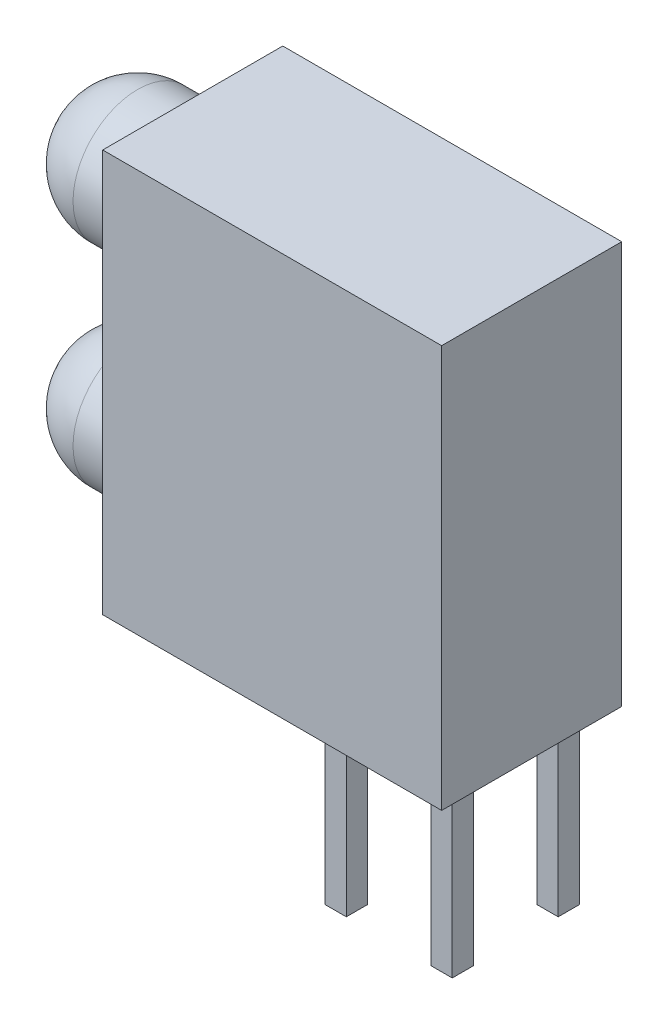
ISO-10303-21;
HEADER;
FILE_DESCRIPTION(('STEP AP214'),'2;1');
FILE_NAME('part.step','',(''),(''),'','','');
FILE_SCHEMA(('AUTOMOTIVE_DESIGN { 1 0 10303 214 1 1 1 1 }'));
ENDSEC;
DATA;
#1=APPLICATION_CONTEXT('core data for automotive mechanical design processes');
#2=APPLICATION_PROTOCOL_DEFINITION('international standard','automotive_design',2000,#1);
#3=PRODUCT_CONTEXT('',#1,'mechanical');
#4=PRODUCT('Part','Part','',(#3));
#5=PRODUCT_RELATED_PRODUCT_CATEGORY('part','',(#4));
#6=PRODUCT_DEFINITION_FORMATION('','',#4);
#7=PRODUCT_DEFINITION_CONTEXT('part definition',#1,'design');
#8=PRODUCT_DEFINITION('design','',#6,#7);
#9=PRODUCT_DEFINITION_SHAPE('','',#8);
#10=(LENGTH_UNIT() NAMED_UNIT(*) SI_UNIT(.MILLI.,.METRE.));
#11=(NAMED_UNIT(*) PLANE_ANGLE_UNIT() SI_UNIT($,.RADIAN.));
#12=(NAMED_UNIT(*) SI_UNIT($,.STERADIAN.) SOLID_ANGLE_UNIT());
#13=UNCERTAINTY_MEASURE_WITH_UNIT(LENGTH_MEASURE(1.E-05),#10,'distance_accuracy_value','');
#14=(GEOMETRIC_REPRESENTATION_CONTEXT(3) GLOBAL_UNCERTAINTY_ASSIGNED_CONTEXT((#13)) GLOBAL_UNIT_ASSIGNED_CONTEXT((#10,
#11,#12)) REPRESENTATION_CONTEXT('',''));
#15=CARTESIAN_POINT('',(0.,0.,0.));
#16=DIRECTION('',(0.,0.,1.));
#17=DIRECTION('',(1.,0.,0.));
#18=AXIS2_PLACEMENT_3D('',#15,#16,#17);
#19=CARTESIAN_POINT('',(0.,0.,0.));
#20=DIRECTION('',(1.,0.,0.));
#21=DIRECTION('',(0.,0.,-1.));
#22=AXIS2_PLACEMENT_3D('',#19,#20,#21);
#23=PLANE('',#22);
#24=CARTESIAN_POINT('',(0.,2.54,0.));
#25=DIRECTION('',(1.,0.,0.));
#26=DIRECTION('',(0.,0.,-1.));
#27=AXIS2_PLACEMENT_3D('',#24,#25,#26);
#28=CIRCLE('',#27,1.5494);
#29=CARTESIAN_POINT('',(0.,2.54,-1.5494));
#30=VERTEX_POINT('',#29);
#31=EDGE_CURVE('E80',#30,#30,#28,.T.);
#32=ORIENTED_EDGE('',*,*,#31,.T.);
#33=EDGE_LOOP('',(#32));
#34=FACE_BOUND('',#33,.T.);
#35=ADVANCED_FACE('F53',(#34),#23,.T.);
#36=CARTESIAN_POINT('',(-1.3208,2.54,0.));
#37=DIRECTION('',(0.,0.,1.));
#38=DIRECTION('',(-1.,0.,0.));
#39=AXIS2_PLACEMENT_3D('',#36,#37,#38);
#40=SPHERICAL_SURFACE('',#39,1.4986);
#41=OFFSET_SURFACE('',#40,0.0508,.F.);
#42=CARTESIAN_POINT('',(-1.3208,2.54,0.));
#43=DIRECTION('',(1.,0.,0.));
#44=DIRECTION('',(0.,0.,1.));
#45=AXIS2_PLACEMENT_3D('',#42,#43,#44);
#46=CIRCLE('',#45,1.5494);
#47=CARTESIAN_POINT('',(-1.3208,2.54,1.5494));
#48=VERTEX_POINT('',#47);
#49=CARTESIAN_POINT('',(-1.32079999999998,2.54,-1.5494));
#50=VERTEX_POINT('',#49);
#51=EDGE_CURVE('E14',#48,#50,#46,.T.);
#52=ORIENTED_EDGE('',*,*,#51,.F.);
#53=CARTESIAN_POINT('',(-1.3208,2.54,0.));
#54=DIRECTION('',(1.,0.,0.));
#55=DIRECTION('',(0.,0.,-1.));
#56=AXIS2_PLACEMENT_3D('',#53,#54,#55);
#57=CIRCLE('',#56,1.5494);
#58=EDGE_CURVE('E66',#48,#50,#57,.F.);
#59=ORIENTED_EDGE('',*,*,#58,.T.);
#60=EDGE_LOOP('',(#52,#59));
#61=FACE_BOUND('',#60,.T.);
#62=ADVANCED_FACE('F74',(#61),#41,.T.);
#63=CARTESIAN_POINT('',(-0.254,2.54,0.));
#64=DIRECTION('',(1.,0.,0.));
#65=DIRECTION('',(0.,1.,0.));
#66=AXIS2_PLACEMENT_3D('',#63,#64,#65);
#67=CYLINDRICAL_SURFACE('',#66,1.5494);
#68=ORIENTED_EDGE('',*,*,#51,.T.);
#69=ORIENTED_EDGE('',*,*,#58,.F.);
#70=EDGE_LOOP('',(#68,#69));
#71=FACE_BOUND('',#70,.T.);
#72=ORIENTED_EDGE('',*,*,#31,.F.);
#73=EDGE_LOOP('',(#72));
#74=FACE_BOUND('',#73,.T.);
#75=ADVANCED_FACE('F78',(#71,#74),#67,.T.);
#76=CLOSED_SHELL('',(#35,#62,#75));
#77=MANIFOLD_SOLID_BREP('B2',#76);
#78=CARTESIAN_POINT('',(0.,0.,0.));
#79=DIRECTION('',(1.,0.,0.));
#80=DIRECTION('',(0.,0.,-1.));
#81=AXIS2_PLACEMENT_3D('',#78,#79,#80);
#82=PLANE('',#81);
#83=CARTESIAN_POINT('',(0.,7.62,0.));
#84=DIRECTION('',(1.,0.,0.));
#85=DIRECTION('',(0.,0.,-1.));
#86=AXIS2_PLACEMENT_3D('',#83,#84,#85);
#87=CIRCLE('',#86,1.5494);
#88=CARTESIAN_POINT('',(0.,7.62,-1.5494));
#89=VERTEX_POINT('',#88);
#90=EDGE_CURVE('E188',#89,#89,#87,.F.);
#91=ORIENTED_EDGE('',*,*,#90,.F.);
#92=EDGE_LOOP('',(#91));
#93=FACE_BOUND('',#92,.T.);
#94=ADVANCED_FACE('F165',(#93),#82,.T.);
#95=CARTESIAN_POINT('',(-1.3208,7.62,0.));
#96=DIRECTION('',(0.,0.,1.));
#97=DIRECTION('',(-1.,0.,0.));
#98=AXIS2_PLACEMENT_3D('',#95,#96,#97);
#99=SPHERICAL_SURFACE('',#98,1.4986);
#100=OFFSET_SURFACE('',#99,0.0508,.F.);
#101=CARTESIAN_POINT('',(-1.3208,7.62,0.));
#102=DIRECTION('',(1.,0.,0.));
#103=DIRECTION('',(0.,0.,1.));
#104=AXIS2_PLACEMENT_3D('',#101,#102,#103);
#105=CIRCLE('',#104,1.5494);
#106=CARTESIAN_POINT('',(-1.32079999999998,7.62,-1.5494));
#107=VERTEX_POINT('',#106);
#108=CARTESIAN_POINT('',(-1.3208,7.62,1.5494));
#109=VERTEX_POINT('',#108);
#110=EDGE_CURVE('E178',#107,#109,#105,.F.);
#111=ORIENTED_EDGE('',*,*,#110,.T.);
#112=CARTESIAN_POINT('',(-1.3208,7.62,0.));
#113=DIRECTION('',(1.,0.,0.));
#114=DIRECTION('',(0.,0.,-1.));
#115=AXIS2_PLACEMENT_3D('',#112,#113,#114);
#116=CIRCLE('',#115,1.5494);
#117=EDGE_CURVE('E51',#109,#107,#116,.F.);
#118=ORIENTED_EDGE('',*,*,#117,.T.);
#119=EDGE_LOOP('',(#111,#118));
#120=FACE_BOUND('',#119,.T.);
#121=ADVANCED_FACE('F185',(#120),#100,.T.);
#122=CARTESIAN_POINT('',(-0.254,7.62,0.));
#123=DIRECTION('',(1.,0.,0.));
#124=DIRECTION('',(0.,1.,0.));
#125=AXIS2_PLACEMENT_3D('',#122,#123,#124);
#126=CYLINDRICAL_SURFACE('',#125,1.5494);
#127=ORIENTED_EDGE('',*,*,#110,.F.);
#128=ORIENTED_EDGE('',*,*,#117,.F.);
#129=EDGE_LOOP('',(#127,#128));
#130=FACE_BOUND('',#129,.T.);
#131=ORIENTED_EDGE('',*,*,#90,.T.);
#132=EDGE_LOOP('',(#131));
#133=FACE_BOUND('',#132,.T.);
#134=ADVANCED_FACE('F191',(#130,#133),#126,.T.);
#135=CLOSED_SHELL('',(#94,#121,#134));
#136=MANIFOLD_SOLID_BREP('B8',#135);
#137=CARTESIAN_POINT('',(0.,0.,2.286));
#138=DIRECTION('',(1.,0.,0.));
#139=DIRECTION('',(0.,0.,-1.));
#140=AXIS2_PLACEMENT_3D('',#137,#138,#139);
#141=PLANE('',#140);
#142=DIRECTION('',(0.,0.,-1.));
#143=VECTOR('',#142,1.);
#144=CARTESIAN_POINT('',(0.,0.,0.));
#145=LINE('',#144,#143);
#146=CARTESIAN_POINT('',(0.,0.,2.159));
#147=VERTEX_POINT('',#146);
#148=CARTESIAN_POINT('',(0.,0.,0.));
#149=VERTEX_POINT('',#148);
#150=EDGE_CURVE('E443',#147,#149,#145,.T.);
#151=ORIENTED_EDGE('',*,*,#150,.F.);
#152=DIRECTION('',(0.,-1.,0.));
#153=VECTOR('',#152,1.);
#154=CARTESIAN_POINT('',(0.,0.,2.159));
#155=LINE('',#154,#153);
#156=CARTESIAN_POINT('',(0.,9.652,2.159));
#157=VERTEX_POINT('',#156);
#158=EDGE_CURVE('E451',#157,#147,#155,.T.);
#159=ORIENTED_EDGE('',*,*,#158,.F.);
#160=DIRECTION('',(0.,0.,1.));
#161=VECTOR('',#160,1.);
#162=CARTESIAN_POINT('',(0.,9.652,0.));
#163=LINE('',#162,#161);
#164=CARTESIAN_POINT('',(0.,9.652,-2.159));
#165=VERTEX_POINT('',#164);
#166=EDGE_CURVE('E446',#165,#157,#163,.T.);
#167=ORIENTED_EDGE('',*,*,#166,.F.);
#168=DIRECTION('',(0.,1.,0.));
#169=VECTOR('',#168,1.);
#170=CARTESIAN_POINT('',(0.,0.,-2.159));
#171=LINE('',#170,#169);
#172=CARTESIAN_POINT('',(0.,0.,-2.159));
#173=VERTEX_POINT('',#172);
#174=EDGE_CURVE('E279',#173,#165,#171,.T.);
#175=ORIENTED_EDGE('',*,*,#174,.F.);
#176=EDGE_CURVE('E452',#149,#173,#145,.T.);
#177=ORIENTED_EDGE('',*,*,#176,.F.);
#178=EDGE_LOOP('',(#151,#159,#167,#175,#177));
#179=FACE_BOUND('',#178,.T.);
#180=ADVANCED_FACE('F268',(#179),#141,.F.);
#181=CARTESIAN_POINT('',(7.239,-3.9878,1.524));
#182=DIRECTION('',(0.,-1.,0.));
#183=DIRECTION('',(0.,0.,-1.));
#184=AXIS2_PLACEMENT_3D('',#181,#182,#183);
#185=PLANE('',#184);
#186=DIRECTION('',(-1.,0.,0.));
#187=VECTOR('',#186,1.);
#188=CARTESIAN_POINT('',(7.493,-3.9878,1.016));
#189=LINE('',#188,#187);
#190=CARTESIAN_POINT('',(7.747,-3.9878,1.016));
#191=VERTEX_POINT('',#190);
#192=CARTESIAN_POINT('',(7.239,-3.9878,1.016));
#193=VERTEX_POINT('',#192);
#194=EDGE_CURVE('E553',#191,#193,#189,.T.);
#195=ORIENTED_EDGE('',*,*,#194,.F.);
#196=DIRECTION('',(0.,0.,1.));
#197=VECTOR('',#196,1.);
#198=CARTESIAN_POINT('',(7.747,-3.9878,1.27));
#199=LINE('',#198,#197);
#200=CARTESIAN_POINT('',(7.747,-3.9878,1.524));
#201=VERTEX_POINT('',#200);
#202=EDGE_CURVE('E489',#191,#201,#199,.T.);
#203=ORIENTED_EDGE('',*,*,#202,.T.);
#204=DIRECTION('',(1.,0.,0.));
#205=VECTOR('',#204,1.);
#206=CARTESIAN_POINT('',(7.493,-3.9878,1.524));
#207=LINE('',#206,#205);
#208=CARTESIAN_POINT('',(7.239,-3.9878,1.524));
#209=VERTEX_POINT('',#208);
#210=EDGE_CURVE('E418',#209,#201,#207,.T.);
#211=ORIENTED_EDGE('',*,*,#210,.F.);
#212=DIRECTION('',(0.,0.,-1.));
#213=VECTOR('',#212,1.);
#214=CARTESIAN_POINT('',(7.239,-3.9878,1.27));
#215=LINE('',#214,#213);
#216=EDGE_CURVE('E414',#209,#193,#215,.T.);
#217=ORIENTED_EDGE('',*,*,#216,.T.);
#218=EDGE_LOOP('',(#195,#203,#211,#217));
#219=FACE_BOUND('',#218,.T.);
#220=ADVANCED_FACE('F606',(#219),#185,.T.);
#221=CARTESIAN_POINT('',(4.699,-3.9878,1.524));
#222=DIRECTION('',(0.,-1.,0.));
#223=DIRECTION('',(0.,0.,-1.));
#224=AXIS2_PLACEMENT_3D('',#221,#222,#223);
#225=PLANE('',#224);
#226=DIRECTION('',(-1.,0.,0.));
#227=VECTOR('',#226,1.);
#228=CARTESIAN_POINT('',(4.953,-3.9878,1.016));
#229=LINE('',#228,#227);
#230=CARTESIAN_POINT('',(5.207,-3.9878,1.016));
#231=VERTEX_POINT('',#230);
#232=CARTESIAN_POINT('',(4.699,-3.9878,1.016));
#233=VERTEX_POINT('',#232);
#234=EDGE_CURVE('E536',#231,#233,#229,.T.);
#235=ORIENTED_EDGE('',*,*,#234,.F.);
#236=DIRECTION('',(0.,0.,1.));
#237=VECTOR('',#236,1.);
#238=CARTESIAN_POINT('',(5.207,-3.9878,1.27));
#239=LINE('',#238,#237);
#240=CARTESIAN_POINT('',(5.207,-3.9878,1.524));
#241=VERTEX_POINT('',#240);
#242=EDGE_CURVE('E483',#231,#241,#239,.T.);
#243=ORIENTED_EDGE('',*,*,#242,.T.);
#244=DIRECTION('',(1.,0.,0.));
#245=VECTOR('',#244,1.);
#246=CARTESIAN_POINT('',(4.953,-3.9878,1.524));
#247=LINE('',#246,#245);
#248=CARTESIAN_POINT('',(4.699,-3.9878,1.524));
#249=VERTEX_POINT('',#248);
#250=EDGE_CURVE('E539',#249,#241,#247,.T.);
#251=ORIENTED_EDGE('',*,*,#250,.F.);
#252=DIRECTION('',(0.,0.,-1.));
#253=VECTOR('',#252,1.);
#254=CARTESIAN_POINT('',(4.699,-3.9878,1.27));
#255=LINE('',#254,#253);
#256=EDGE_CURVE('E548',#249,#233,#255,.T.);
#257=ORIENTED_EDGE('',*,*,#256,.T.);
#258=EDGE_LOOP('',(#235,#243,#251,#257));
#259=FACE_BOUND('',#258,.T.);
#260=ADVANCED_FACE('F610',(#259),#225,.T.);
#261=CARTESIAN_POINT('',(7.239,-3.9878,-1.016));
#262=DIRECTION('',(0.,-1.,0.));
#263=DIRECTION('',(0.,0.,-1.));
#264=AXIS2_PLACEMENT_3D('',#261,#262,#263);
#265=PLANE('',#264);
#266=DIRECTION('',(-1.,0.,0.));
#267=VECTOR('',#266,1.);
#268=CARTESIAN_POINT('',(7.493,-3.9878,-1.524));
#269=LINE('',#268,#267);
#270=CARTESIAN_POINT('',(7.747,-3.9878,-1.524));
#271=VERTEX_POINT('',#270);
#272=CARTESIAN_POINT('',(7.239,-3.9878,-1.524));
#273=VERTEX_POINT('',#272);
#274=EDGE_CURVE('E497',#271,#273,#269,.T.);
#275=ORIENTED_EDGE('',*,*,#274,.F.);
#276=DIRECTION('',(0.,0.,1.));
#277=VECTOR('',#276,1.);
#278=CARTESIAN_POINT('',(7.747,-3.9878,-1.27));
#279=LINE('',#278,#277);
#280=CARTESIAN_POINT('',(7.747,-3.9878,-1.016));
#281=VERTEX_POINT('',#280);
#282=EDGE_CURVE('E324',#271,#281,#279,.T.);
#283=ORIENTED_EDGE('',*,*,#282,.T.);
#284=DIRECTION('',(1.,0.,0.));
#285=VECTOR('',#284,1.);
#286=CARTESIAN_POINT('',(7.493,-3.9878,-1.016));
#287=LINE('',#286,#285);
#288=CARTESIAN_POINT('',(7.239,-3.9878,-1.016));
#289=VERTEX_POINT('',#288);
#290=EDGE_CURVE('E500',#289,#281,#287,.T.);
#291=ORIENTED_EDGE('',*,*,#290,.F.);
#292=DIRECTION('',(0.,0.,-1.));
#293=VECTOR('',#292,1.);
#294=CARTESIAN_POINT('',(7.239,-3.9878,-1.27));
#295=LINE('',#294,#293);
#296=EDGE_CURVE('E508',#289,#273,#295,.T.);
#297=ORIENTED_EDGE('',*,*,#296,.T.);
#298=EDGE_LOOP('',(#275,#283,#291,#297));
#299=FACE_BOUND('',#298,.T.);
#300=ADVANCED_FACE('F615',(#299),#265,.T.);
#301=CARTESIAN_POINT('',(4.699,-3.9878,-1.016));
#302=DIRECTION('',(0.,-1.,0.));
#303=DIRECTION('',(0.,0.,-1.));
#304=AXIS2_PLACEMENT_3D('',#301,#302,#303);
#305=PLANE('',#304);
#306=DIRECTION('',(-1.,0.,0.));
#307=VECTOR('',#306,1.);
#308=CARTESIAN_POINT('',(4.953,-3.9878,-1.524));
#309=LINE('',#308,#307);
#310=CARTESIAN_POINT('',(5.207,-3.9878,-1.524));
#311=VERTEX_POINT('',#310);
#312=CARTESIAN_POINT('',(4.699,-3.9878,-1.524));
#313=VERTEX_POINT('',#312);
#314=EDGE_CURVE('E516',#311,#313,#309,.T.);
#315=ORIENTED_EDGE('',*,*,#314,.F.);
#316=DIRECTION('',(0.,0.,1.));
#317=VECTOR('',#316,1.);
#318=CARTESIAN_POINT('',(5.207,-3.9878,-1.27));
#319=LINE('',#318,#317);
#320=CARTESIAN_POINT('',(5.207,-3.9878,-1.016));
#321=VERTEX_POINT('',#320);
#322=EDGE_CURVE('E475',#311,#321,#319,.T.);
#323=ORIENTED_EDGE('',*,*,#322,.T.);
#324=DIRECTION('',(1.,0.,0.));
#325=VECTOR('',#324,1.);
#326=CARTESIAN_POINT('',(4.953,-3.9878,-1.016));
#327=LINE('',#326,#325);
#328=CARTESIAN_POINT('',(4.699,-3.9878,-1.016));
#329=VERTEX_POINT('',#328);
#330=EDGE_CURVE('E519',#329,#321,#327,.T.);
#331=ORIENTED_EDGE('',*,*,#330,.F.);
#332=DIRECTION('',(0.,0.,-1.));
#333=VECTOR('',#332,1.);
#334=CARTESIAN_POINT('',(4.699,-3.9878,-1.27));
#335=LINE('',#334,#333);
#336=EDGE_CURVE('E528',#329,#313,#335,.T.);
#337=ORIENTED_EDGE('',*,*,#336,.T.);
#338=EDGE_LOOP('',(#315,#323,#331,#337));
#339=FACE_BOUND('',#338,.T.);
#340=ADVANCED_FACE('F638',(#339),#305,.T.);
#341=CARTESIAN_POINT('',(7.747,-3.9878,1.016));
#342=DIRECTION('',(-1.,0.,0.));
#343=DIRECTION('',(0.,0.,1.));
#344=AXIS2_PLACEMENT_3D('',#341,#342,#343);
#345=PLANE('',#344);
#346=DIRECTION('',(0.,0.,1.));
#347=VECTOR('',#346,1.);
#348=CARTESIAN_POINT('',(7.747,0.,0.));
#349=LINE('',#348,#347);
#350=CARTESIAN_POINT('',(7.747,0.,1.015999999746));
#351=VERTEX_POINT('',#350);
#352=CARTESIAN_POINT('',(7.747,0.,1.523999999619));
#353=VERTEX_POINT('',#352);
#354=EDGE_CURVE('E560',#351,#353,#349,.T.);
#355=ORIENTED_EDGE('',*,*,#354,.T.);
#356=DIRECTION('',(0.,1.,0.));
#357=VECTOR('',#356,1.);
#358=CARTESIAN_POINT('',(7.747,-1.9939,1.524));
#359=LINE('',#358,#357);
#360=EDGE_CURVE('E422',#201,#353,#359,.T.);
#361=ORIENTED_EDGE('',*,*,#360,.F.);
#362=ORIENTED_EDGE('',*,*,#202,.F.);
#363=DIRECTION('',(0.,-1.,0.));
#364=VECTOR('',#363,1.);
#365=CARTESIAN_POINT('',(7.747,-1.9939,1.016));
#366=LINE('',#365,#364);
#367=EDGE_CURVE('E485',#351,#191,#366,.T.);
#368=ORIENTED_EDGE('',*,*,#367,.F.);
#369=EDGE_LOOP('',(#355,#361,#362,#368));
#370=FACE_BOUND('',#369,.T.);
#371=ADVANCED_FACE('F558',(#370),#345,.F.);
#372=CARTESIAN_POINT('',(7.239,-3.9878,1.524));
#373=DIRECTION('',(0.,0.,1.));
#374=DIRECTION('',(1.,0.,0.));
#375=AXIS2_PLACEMENT_3D('',#372,#373,#374);
#376=PLANE('',#375);
#377=ORIENTED_EDGE('',*,*,#210,.T.);
#378=ORIENTED_EDGE('',*,*,#360,.T.);
#379=DIRECTION('',(-1.,0.,0.));
#380=VECTOR('',#379,1.);
#381=CARTESIAN_POINT('',(7.493,0.,1.524));
#382=LINE('',#381,#380);
#383=CARTESIAN_POINT('',(7.239,0.,1.523999999238));
#384=VERTEX_POINT('',#383);
#385=EDGE_CURVE('E402',#353,#384,#382,.T.);
#386=ORIENTED_EDGE('',*,*,#385,.T.);
#387=DIRECTION('',(0.,-1.,0.));
#388=VECTOR('',#387,1.);
#389=CARTESIAN_POINT('',(7.239,-1.9939,1.524));
#390=LINE('',#389,#388);
#391=EDGE_CURVE('E412',#384,#209,#390,.T.);
#392=ORIENTED_EDGE('',*,*,#391,.T.);
#393=EDGE_LOOP('',(#377,#378,#386,#392));
#394=FACE_BOUND('',#393,.T.);
#395=ADVANCED_FACE('F420',(#394),#376,.T.);
#396=CARTESIAN_POINT('',(7.239,-3.9878,1.016));
#397=DIRECTION('',(-1.,0.,0.));
#398=DIRECTION('',(0.,0.,1.));
#399=AXIS2_PLACEMENT_3D('',#396,#397,#398);
#400=PLANE('',#399);
#401=ORIENTED_EDGE('',*,*,#391,.F.);
#402=DIRECTION('',(0.,0.,-1.));
#403=VECTOR('',#402,1.);
#404=CARTESIAN_POINT('',(7.239,0.,1.27));
#405=LINE('',#404,#403);
#406=CARTESIAN_POINT('',(7.239,0.,1.015999999746));
#407=VERTEX_POINT('',#406);
#408=EDGE_CURVE('E396',#384,#407,#405,.T.);
#409=ORIENTED_EDGE('',*,*,#408,.T.);
#410=DIRECTION('',(0.,1.,0.));
#411=VECTOR('',#410,1.);
#412=CARTESIAN_POINT('',(7.239,-1.9939,1.016));
#413=LINE('',#412,#411);
#414=EDGE_CURVE('E551',#193,#407,#413,.T.);
#415=ORIENTED_EDGE('',*,*,#414,.F.);
#416=ORIENTED_EDGE('',*,*,#216,.F.);
#417=EDGE_LOOP('',(#401,#409,#415,#416));
#418=FACE_BOUND('',#417,.T.);
#419=ADVANCED_FACE('F413',(#418),#400,.T.);
#420=CARTESIAN_POINT('',(7.747,-3.9878,1.016));
#421=DIRECTION('',(0.,0.,-1.));
#422=DIRECTION('',(-1.,0.,0.));
#423=AXIS2_PLACEMENT_3D('',#420,#421,#422);
#424=PLANE('',#423);
#425=DIRECTION('',(1.,0.,0.));
#426=VECTOR('',#425,1.);
#427=CARTESIAN_POINT('',(7.493,0.,1.016));
#428=LINE('',#427,#426);
#429=EDGE_CURVE('E405',#407,#351,#428,.T.);
#430=ORIENTED_EDGE('',*,*,#429,.T.);
#431=ORIENTED_EDGE('',*,*,#367,.T.);
#432=ORIENTED_EDGE('',*,*,#194,.T.);
#433=ORIENTED_EDGE('',*,*,#414,.T.);
#434=EDGE_LOOP('',(#430,#431,#432,#433));
#435=FACE_BOUND('',#434,.T.);
#436=ADVANCED_FACE('F624',(#435),#424,.T.);
#437=CARTESIAN_POINT('',(5.207,-3.9878,1.016));
#438=DIRECTION('',(-1.,0.,0.));
#439=DIRECTION('',(0.,0.,1.));
#440=AXIS2_PLACEMENT_3D('',#437,#438,#439);
#441=PLANE('',#440);
#442=DIRECTION('',(0.,0.,1.));
#443=VECTOR('',#442,1.);
#444=CARTESIAN_POINT('',(5.207,0.,0.));
#445=LINE('',#444,#443);
#446=CARTESIAN_POINT('',(5.207,0.,1.015999999746));
#447=VERTEX_POINT('',#446);
#448=CARTESIAN_POINT('',(5.207,0.,1.523999999619));
#449=VERTEX_POINT('',#448);
#450=EDGE_CURVE('E562',#447,#449,#445,.T.);
#451=ORIENTED_EDGE('',*,*,#450,.T.);
#452=DIRECTION('',(0.,1.,0.));
#453=VECTOR('',#452,1.);
#454=CARTESIAN_POINT('',(5.207,-1.9939,1.524));
#455=LINE('',#454,#453);
#456=EDGE_CURVE('E480',#241,#449,#455,.T.);
#457=ORIENTED_EDGE('',*,*,#456,.F.);
#458=ORIENTED_EDGE('',*,*,#242,.F.);
#459=DIRECTION('',(0.,-1.,0.));
#460=VECTOR('',#459,1.);
#461=CARTESIAN_POINT('',(5.207,-1.9939,1.016));
#462=LINE('',#461,#460);
#463=EDGE_CURVE('E477',#447,#231,#462,.T.);
#464=ORIENTED_EDGE('',*,*,#463,.F.);
#465=EDGE_LOOP('',(#451,#457,#458,#464));
#466=FACE_BOUND('',#465,.T.);
#467=ADVANCED_FACE('F626',(#466),#441,.F.);
#468=CARTESIAN_POINT('',(4.699,0.,1.524));
#469=DIRECTION('',(0.,0.,1.));
#470=DIRECTION('',(0.,-1.,0.));
#471=AXIS2_PLACEMENT_3D('',#468,#469,#470);
#472=PLANE('',#471);
#473=ORIENTED_EDGE('',*,*,#250,.T.);
#474=ORIENTED_EDGE('',*,*,#456,.T.);
#475=DIRECTION('',(-1.,0.,0.));
#476=VECTOR('',#475,1.);
#477=CARTESIAN_POINT('',(4.953,0.,1.524));
#478=LINE('',#477,#476);
#479=CARTESIAN_POINT('',(4.699,0.,1.523999999238));
#480=VERTEX_POINT('',#479);
#481=EDGE_CURVE('E545',#449,#480,#478,.T.);
#482=ORIENTED_EDGE('',*,*,#481,.T.);
#483=DIRECTION('',(0.,-1.,0.));
#484=VECTOR('',#483,1.);
#485=CARTESIAN_POINT('',(4.699,-1.9939,1.524));
#486=LINE('',#485,#484);
#487=EDGE_CURVE('E542',#480,#249,#486,.T.);
#488=ORIENTED_EDGE('',*,*,#487,.T.);
#489=EDGE_LOOP('',(#473,#474,#482,#488));
#490=FACE_BOUND('',#489,.T.);
#491=ADVANCED_FACE('F629',(#490),#472,.T.);
#492=CARTESIAN_POINT('',(4.699,-3.9878,1.016));
#493=DIRECTION('',(-1.,0.,0.));
#494=DIRECTION('',(0.,0.,1.));
#495=AXIS2_PLACEMENT_3D('',#492,#493,#494);
#496=PLANE('',#495);
#497=ORIENTED_EDGE('',*,*,#487,.F.);
#498=DIRECTION('',(0.,0.,-1.));
#499=VECTOR('',#498,1.);
#500=CARTESIAN_POINT('',(4.699,0.,1.27));
#501=LINE('',#500,#499);
#502=CARTESIAN_POINT('',(4.699,0.,1.015999999746));
#503=VERTEX_POINT('',#502);
#504=EDGE_CURVE('E409',#480,#503,#501,.T.);
#505=ORIENTED_EDGE('',*,*,#504,.T.);
#506=DIRECTION('',(0.,1.,0.));
#507=VECTOR('',#506,1.);
#508=CARTESIAN_POINT('',(4.699,-1.9939,1.016));
#509=LINE('',#508,#507);
#510=EDGE_CURVE('E533',#233,#503,#509,.T.);
#511=ORIENTED_EDGE('',*,*,#510,.F.);
#512=ORIENTED_EDGE('',*,*,#256,.F.);
#513=EDGE_LOOP('',(#497,#505,#511,#512));
#514=FACE_BOUND('',#513,.T.);
#515=ADVANCED_FACE('F632',(#514),#496,.T.);
#516=CARTESIAN_POINT('',(4.699,-3.9878,1.016));
#517=DIRECTION('',(0.,0.,-1.));
#518=DIRECTION('',(0.,1.,0.));
#519=AXIS2_PLACEMENT_3D('',#516,#517,#518);
#520=PLANE('',#519);
#521=DIRECTION('',(1.,0.,0.));
#522=VECTOR('',#521,1.);
#523=CARTESIAN_POINT('',(4.953,0.,1.016));
#524=LINE('',#523,#522);
#525=EDGE_CURVE('E530',#503,#447,#524,.T.);
#526=ORIENTED_EDGE('',*,*,#525,.T.);
#527=ORIENTED_EDGE('',*,*,#463,.T.);
#528=ORIENTED_EDGE('',*,*,#234,.T.);
#529=ORIENTED_EDGE('',*,*,#510,.T.);
#530=EDGE_LOOP('',(#526,#527,#528,#529));
#531=FACE_BOUND('',#530,.T.);
#532=ADVANCED_FACE('F634',(#531),#520,.T.);
#533=CARTESIAN_POINT('',(8.128,0.,2.159));
#534=DIRECTION('',(0.,0.,-1.));
#535=DIRECTION('',(-1.,0.,0.));
#536=AXIS2_PLACEMENT_3D('',#533,#534,#535);
#537=PLANE('',#536);
#538=DIRECTION('',(1.,0.,0.));
#539=VECTOR('',#538,1.);
#540=CARTESIAN_POINT('',(8.128,0.,2.159));
#541=LINE('',#540,#539);
#542=CARTESIAN_POINT('',(8.128,0.,2.159));
#543=VERTEX_POINT('',#542);
#544=EDGE_CURVE('E447',#147,#543,#541,.T.);
#545=ORIENTED_EDGE('',*,*,#544,.T.);
#546=DIRECTION('',(0.,-1.,0.));
#547=VECTOR('',#546,1.);
#548=CARTESIAN_POINT('',(8.128,0.,2.159));
#549=LINE('',#548,#547);
#550=CARTESIAN_POINT('',(8.128,9.652,2.159));
#551=VERTEX_POINT('',#550);
#552=EDGE_CURVE('E272',#551,#543,#549,.T.);
#553=ORIENTED_EDGE('',*,*,#552,.F.);
#554=DIRECTION('',(1.,0.,0.));
#555=VECTOR('',#554,1.);
#556=CARTESIAN_POINT('',(0.,9.652,2.159));
#557=LINE('',#556,#555);
#558=EDGE_CURVE('E453',#157,#551,#557,.T.);
#559=ORIENTED_EDGE('',*,*,#558,.F.);
#560=ORIENTED_EDGE('',*,*,#158,.T.);
#561=EDGE_LOOP('',(#545,#553,#559,#560));
#562=FACE_BOUND('',#561,.T.);
#563=ADVANCED_FACE('F270',(#562),#537,.F.);
#564=CARTESIAN_POINT('',(0.,9.652,2.286));
#565=DIRECTION('',(0.,-1.,0.));
#566=DIRECTION('',(0.,0.,-1.));
#567=AXIS2_PLACEMENT_3D('',#564,#565,#566);
#568=PLANE('',#567);
#569=ORIENTED_EDGE('',*,*,#166,.T.);
#570=ORIENTED_EDGE('',*,*,#558,.T.);
#571=DIRECTION('',(0.,0.,1.));
#572=VECTOR('',#571,1.);
#573=CARTESIAN_POINT('',(8.128,9.652,0.));
#574=LINE('',#573,#572);
#575=CARTESIAN_POINT('',(8.128,9.652,-2.159));
#576=VERTEX_POINT('',#575);
#577=EDGE_CURVE('E314',#576,#551,#574,.T.);
#578=ORIENTED_EDGE('',*,*,#577,.F.);
#579=DIRECTION('',(1.,0.,0.));
#580=VECTOR('',#579,1.);
#581=CARTESIAN_POINT('',(0.,9.652,-2.159));
#582=LINE('',#581,#580);
#583=EDGE_CURVE('E437',#165,#576,#582,.T.);
#584=ORIENTED_EDGE('',*,*,#583,.F.);
#585=EDGE_LOOP('',(#569,#570,#578,#584));
#586=FACE_BOUND('',#585,.T.);
#587=ADVANCED_FACE('F584',(#586),#568,.F.);
#588=CARTESIAN_POINT('',(8.128,0.,-2.286));
#589=DIRECTION('',(-1.,0.,0.));
#590=DIRECTION('',(0.,0.,1.));
#591=AXIS2_PLACEMENT_3D('',#588,#589,#590);
#592=PLANE('',#591);
#593=ORIENTED_EDGE('',*,*,#577,.T.);
#594=ORIENTED_EDGE('',*,*,#552,.T.);
#595=DIRECTION('',(0.,0.,-1.));
#596=VECTOR('',#595,1.);
#597=CARTESIAN_POINT('',(8.128,0.,0.));
#598=LINE('',#597,#596);
#599=CARTESIAN_POINT('',(8.128,0.,0.));
#600=VERTEX_POINT('',#599);
#601=EDGE_CURVE('E463',#543,#600,#598,.T.);
#602=ORIENTED_EDGE('',*,*,#601,.T.);
#603=CARTESIAN_POINT('',(8.128,0.,-2.159));
#604=VERTEX_POINT('',#603);
#605=EDGE_CURVE('E450',#600,#604,#598,.T.);
#606=ORIENTED_EDGE('',*,*,#605,.T.);
#607=DIRECTION('',(0.,-1.,0.));
#608=VECTOR('',#607,1.);
#609=CARTESIAN_POINT('',(8.128,0.,-2.159));
#610=LINE('',#609,#608);
#611=EDGE_CURVE('E433',#576,#604,#610,.T.);
#612=ORIENTED_EDGE('',*,*,#611,.F.);
#613=EDGE_LOOP('',(#593,#594,#602,#606,#612));
#614=FACE_BOUND('',#613,.T.);
#615=ADVANCED_FACE('F587',(#614),#592,.F.);
#616=CARTESIAN_POINT('',(8.128,0.,-2.159));
#617=DIRECTION('',(0.,0.,-1.));
#618=DIRECTION('',(-1.,0.,0.));
#619=AXIS2_PLACEMENT_3D('',#616,#617,#618);
#620=PLANE('',#619);
#621=ORIENTED_EDGE('',*,*,#611,.T.);
#622=DIRECTION('',(-1.,0.,0.));
#623=VECTOR('',#622,1.);
#624=CARTESIAN_POINT('',(0.,0.,-2.159));
#625=LINE('',#624,#623);
#626=EDGE_CURVE('E436',#604,#173,#625,.T.);
#627=ORIENTED_EDGE('',*,*,#626,.T.);
#628=ORIENTED_EDGE('',*,*,#174,.T.);
#629=ORIENTED_EDGE('',*,*,#583,.T.);
#630=EDGE_LOOP('',(#621,#627,#628,#629));
#631=FACE_BOUND('',#630,.T.);
#632=ADVANCED_FACE('F581',(#631),#620,.T.);
#633=CARTESIAN_POINT('',(0.,0.,-2.286));
#634=DIRECTION('',(0.,1.,0.));
#635=DIRECTION('',(0.,0.,1.));
#636=AXIS2_PLACEMENT_3D('',#633,#634,#635);
#637=PLANE('',#636);
#638=ORIENTED_EDGE('',*,*,#525,.F.);
#639=ORIENTED_EDGE('',*,*,#504,.F.);
#640=ORIENTED_EDGE('',*,*,#481,.F.);
#641=ORIENTED_EDGE('',*,*,#450,.F.);
#642=EDGE_LOOP('',(#638,#639,#640,#641));
#643=FACE_BOUND('',#642,.T.);
#644=ORIENTED_EDGE('',*,*,#429,.F.);
#645=ORIENTED_EDGE('',*,*,#408,.F.);
#646=ORIENTED_EDGE('',*,*,#385,.F.);
#647=ORIENTED_EDGE('',*,*,#354,.F.);
#648=EDGE_LOOP('',(#644,#645,#646,#647));
#649=FACE_BOUND('',#648,.T.);
#650=ORIENTED_EDGE('',*,*,#150,.T.);
#651=DIRECTION('',(1.,0.,0.));
#652=VECTOR('',#651,1.);
#653=CARTESIAN_POINT('',(0.,0.,0.));
#654=LINE('',#653,#652);
#655=EDGE_CURVE('E163',#149,#600,#654,.T.);
#656=ORIENTED_EDGE('',*,*,#655,.T.);
#657=ORIENTED_EDGE('',*,*,#601,.F.);
#658=ORIENTED_EDGE('',*,*,#544,.F.);
#659=EDGE_LOOP('',(#650,#656,#657,#658));
#660=FACE_BOUND('',#659,.T.);
#661=ADVANCED_FACE('F398',(#643,#649,#660),#637,.F.);
#662=CARTESIAN_POINT('',(7.747,-3.9878,-1.524));
#663=DIRECTION('',(-1.,0.,0.));
#664=DIRECTION('',(0.,0.,1.));
#665=AXIS2_PLACEMENT_3D('',#662,#663,#664);
#666=PLANE('',#665);
#667=DIRECTION('',(0.,0.,1.));
#668=VECTOR('',#667,1.);
#669=CARTESIAN_POINT('',(7.747,0.,0.));
#670=LINE('',#669,#668);
#671=CARTESIAN_POINT('',(7.747,0.,-1.523999999619));
#672=VERTEX_POINT('',#671);
#673=CARTESIAN_POINT('',(7.747,0.,-1.015999999746));
#674=VERTEX_POINT('',#673);
#675=EDGE_CURVE('E440',#672,#674,#670,.T.);
#676=ORIENTED_EDGE('',*,*,#675,.T.);
#677=DIRECTION('',(0.,1.,0.));
#678=VECTOR('',#677,1.);
#679=CARTESIAN_POINT('',(7.747,-1.9939,-1.016));
#680=LINE('',#679,#678);
#681=EDGE_CURVE('E460',#281,#674,#680,.T.);
#682=ORIENTED_EDGE('',*,*,#681,.F.);
#683=ORIENTED_EDGE('',*,*,#282,.F.);
#684=DIRECTION('',(0.,-1.,0.));
#685=VECTOR('',#684,1.);
#686=CARTESIAN_POINT('',(7.747,-1.9939,-1.524));
#687=LINE('',#686,#685);
#688=EDGE_CURVE('E457',#672,#271,#687,.T.);
#689=ORIENTED_EDGE('',*,*,#688,.F.);
#690=EDGE_LOOP('',(#676,#682,#683,#689));
#691=FACE_BOUND('',#690,.T.);
#692=ADVANCED_FACE('F589',(#691),#666,.F.);
#693=CARTESIAN_POINT('',(7.239,-3.9878,-1.016));
#694=DIRECTION('',(0.,0.,1.));
#695=DIRECTION('',(1.,0.,0.));
#696=AXIS2_PLACEMENT_3D('',#693,#694,#695);
#697=PLANE('',#696);
#698=ORIENTED_EDGE('',*,*,#290,.T.);
#699=ORIENTED_EDGE('',*,*,#681,.T.);
#700=DIRECTION('',(-1.,0.,0.));
#701=VECTOR('',#700,1.);
#702=CARTESIAN_POINT('',(7.493,0.,-1.016));
#703=LINE('',#702,#701);
#704=CARTESIAN_POINT('',(7.239,0.,-1.015999999492));
#705=VERTEX_POINT('',#704);
#706=EDGE_CURVE('E505',#674,#705,#703,.T.);
#707=ORIENTED_EDGE('',*,*,#706,.T.);
#708=DIRECTION('',(0.,-1.,0.));
#709=VECTOR('',#708,1.);
#710=CARTESIAN_POINT('',(7.239,-1.9939,-1.016));
#711=LINE('',#710,#709);
#712=EDGE_CURVE('E502',#705,#289,#711,.T.);
#713=ORIENTED_EDGE('',*,*,#712,.T.);
#714=EDGE_LOOP('',(#698,#699,#707,#713));
#715=FACE_BOUND('',#714,.T.);
#716=ADVANCED_FACE('F596',(#715),#697,.T.);
#717=CARTESIAN_POINT('',(7.239,-3.9878,-1.524));
#718=DIRECTION('',(-1.,0.,0.));
#719=DIRECTION('',(0.,0.,1.));
#720=AXIS2_PLACEMENT_3D('',#717,#718,#719);
#721=PLANE('',#720);
#722=ORIENTED_EDGE('',*,*,#712,.F.);
#723=DIRECTION('',(0.,0.,-1.));
#724=VECTOR('',#723,1.);
#725=CARTESIAN_POINT('',(7.239,0.,-1.27));
#726=LINE('',#725,#724);
#727=CARTESIAN_POINT('',(7.239,0.,-1.523999999619));
#728=VERTEX_POINT('',#727);
#729=EDGE_CURVE('E425',#705,#728,#726,.T.);
#730=ORIENTED_EDGE('',*,*,#729,.T.);
#731=DIRECTION('',(0.,1.,0.));
#732=VECTOR('',#731,1.);
#733=CARTESIAN_POINT('',(7.239,-1.9939,-1.524));
#734=LINE('',#733,#732);
#735=EDGE_CURVE('E494',#273,#728,#734,.T.);
#736=ORIENTED_EDGE('',*,*,#735,.F.);
#737=ORIENTED_EDGE('',*,*,#296,.F.);
#738=EDGE_LOOP('',(#722,#730,#736,#737));
#739=FACE_BOUND('',#738,.T.);
#740=ADVANCED_FACE('F620',(#739),#721,.T.);
#741=CARTESIAN_POINT('',(7.747,-3.9878,-1.524));
#742=DIRECTION('',(0.,0.,-1.));
#743=DIRECTION('',(-1.,0.,0.));
#744=AXIS2_PLACEMENT_3D('',#741,#742,#743);
#745=PLANE('',#744);
#746=DIRECTION('',(1.,0.,0.));
#747=VECTOR('',#746,1.);
#748=CARTESIAN_POINT('',(7.493,0.,-1.524));
#749=LINE('',#748,#747);
#750=EDGE_CURVE('E491',#728,#672,#749,.T.);
#751=ORIENTED_EDGE('',*,*,#750,.T.);
#752=ORIENTED_EDGE('',*,*,#688,.T.);
#753=ORIENTED_EDGE('',*,*,#274,.T.);
#754=ORIENTED_EDGE('',*,*,#735,.T.);
#755=EDGE_LOOP('',(#751,#752,#753,#754));
#756=FACE_BOUND('',#755,.T.);
#757=ADVANCED_FACE('F656',(#756),#745,.T.);
#758=CARTESIAN_POINT('',(5.207,-3.9878,-1.524));
#759=DIRECTION('',(-1.,0.,0.));
#760=DIRECTION('',(0.,0.,1.));
#761=AXIS2_PLACEMENT_3D('',#758,#759,#760);
#762=PLANE('',#761);
#763=DIRECTION('',(0.,0.,1.));
#764=VECTOR('',#763,1.);
#765=CARTESIAN_POINT('',(5.207,0.,0.));
#766=LINE('',#765,#764);
#767=CARTESIAN_POINT('',(5.207,0.,-1.523999999619));
#768=VERTEX_POINT('',#767);
#769=CARTESIAN_POINT('',(5.207,0.,-1.015999999746));
#770=VERTEX_POINT('',#769);
#771=EDGE_CURVE('E564',#768,#770,#766,.T.);
#772=ORIENTED_EDGE('',*,*,#771,.T.);
#773=DIRECTION('',(0.,1.,0.));
#774=VECTOR('',#773,1.);
#775=CARTESIAN_POINT('',(5.207,-1.9939,-1.016));
#776=LINE('',#775,#774);
#777=EDGE_CURVE('E472',#321,#770,#776,.T.);
#778=ORIENTED_EDGE('',*,*,#777,.F.);
#779=ORIENTED_EDGE('',*,*,#322,.F.);
#780=DIRECTION('',(0.,-1.,0.));
#781=VECTOR('',#780,1.);
#782=CARTESIAN_POINT('',(5.207,-1.9939,-1.524));
#783=LINE('',#782,#781);
#784=EDGE_CURVE('E469',#768,#311,#783,.T.);
#785=ORIENTED_EDGE('',*,*,#784,.F.);
#786=EDGE_LOOP('',(#772,#778,#779,#785));
#787=FACE_BOUND('',#786,.T.);
#788=ADVANCED_FACE('F646',(#787),#762,.F.);
#789=CARTESIAN_POINT('',(4.699,0.,-1.016));
#790=DIRECTION('',(0.,0.,1.));
#791=DIRECTION('',(0.,-1.,0.));
#792=AXIS2_PLACEMENT_3D('',#789,#790,#791);
#793=PLANE('',#792);
#794=ORIENTED_EDGE('',*,*,#330,.T.);
#795=ORIENTED_EDGE('',*,*,#777,.T.);
#796=DIRECTION('',(-1.,0.,0.));
#797=VECTOR('',#796,1.);
#798=CARTESIAN_POINT('',(4.953,0.,-1.016));
#799=LINE('',#798,#797);
#800=CARTESIAN_POINT('',(4.699,0.,-1.015999999492));
#801=VERTEX_POINT('',#800);
#802=EDGE_CURVE('E525',#770,#801,#799,.T.);
#803=ORIENTED_EDGE('',*,*,#802,.T.);
#804=DIRECTION('',(0.,-1.,0.));
#805=VECTOR('',#804,1.);
#806=CARTESIAN_POINT('',(4.699,-1.9939,-1.016));
#807=LINE('',#806,#805);
#808=EDGE_CURVE('E522',#801,#329,#807,.T.);
#809=ORIENTED_EDGE('',*,*,#808,.T.);
#810=EDGE_LOOP('',(#794,#795,#803,#809));
#811=FACE_BOUND('',#810,.T.);
#812=ADVANCED_FACE('F642',(#811),#793,.T.);
#813=CARTESIAN_POINT('',(4.699,-3.9878,-1.524));
#814=DIRECTION('',(-1.,0.,0.));
#815=DIRECTION('',(0.,0.,1.));
#816=AXIS2_PLACEMENT_3D('',#813,#814,#815);
#817=PLANE('',#816);
#818=ORIENTED_EDGE('',*,*,#808,.F.);
#819=DIRECTION('',(0.,0.,-1.));
#820=VECTOR('',#819,1.);
#821=CARTESIAN_POINT('',(4.699,0.,-1.27));
#822=LINE('',#821,#820);
#823=CARTESIAN_POINT('',(4.699,0.,-1.523999999619));
#824=VERTEX_POINT('',#823);
#825=EDGE_CURVE('E430',#801,#824,#822,.T.);
#826=ORIENTED_EDGE('',*,*,#825,.T.);
#827=DIRECTION('',(0.,1.,0.));
#828=VECTOR('',#827,1.);
#829=CARTESIAN_POINT('',(4.699,-1.9939,-1.524));
#830=LINE('',#829,#828);
#831=EDGE_CURVE('E513',#313,#824,#830,.T.);
#832=ORIENTED_EDGE('',*,*,#831,.F.);
#833=ORIENTED_EDGE('',*,*,#336,.F.);
#834=EDGE_LOOP('',(#818,#826,#832,#833));
#835=FACE_BOUND('',#834,.T.);
#836=ADVANCED_FACE('F645',(#835),#817,.T.);
#837=CARTESIAN_POINT('',(4.699,-3.9878,-1.524));
#838=DIRECTION('',(0.,0.,-1.));
#839=DIRECTION('',(0.,1.,0.));
#840=AXIS2_PLACEMENT_3D('',#837,#838,#839);
#841=PLANE('',#840);
#842=DIRECTION('',(1.,0.,0.));
#843=VECTOR('',#842,1.);
#844=CARTESIAN_POINT('',(4.953,0.,-1.524));
#845=LINE('',#844,#843);
#846=EDGE_CURVE('E510',#824,#768,#845,.T.);
#847=ORIENTED_EDGE('',*,*,#846,.T.);
#848=ORIENTED_EDGE('',*,*,#784,.T.);
#849=ORIENTED_EDGE('',*,*,#314,.T.);
#850=ORIENTED_EDGE('',*,*,#831,.T.);
#851=EDGE_LOOP('',(#847,#848,#849,#850));
#852=FACE_BOUND('',#851,.T.);
#853=ADVANCED_FACE('F603',(#852),#841,.T.);
#854=ORIENTED_EDGE('',*,*,#846,.F.);
#855=ORIENTED_EDGE('',*,*,#825,.F.);
#856=ORIENTED_EDGE('',*,*,#802,.F.);
#857=ORIENTED_EDGE('',*,*,#771,.F.);
#858=EDGE_LOOP('',(#854,#855,#856,#857));
#859=FACE_BOUND('',#858,.T.);
#860=ORIENTED_EDGE('',*,*,#750,.F.);
#861=ORIENTED_EDGE('',*,*,#729,.F.);
#862=ORIENTED_EDGE('',*,*,#706,.F.);
#863=ORIENTED_EDGE('',*,*,#675,.F.);
#864=EDGE_LOOP('',(#860,#861,#862,#863));
#865=FACE_BOUND('',#864,.T.);
#866=ORIENTED_EDGE('',*,*,#655,.F.);
#867=ORIENTED_EDGE('',*,*,#176,.T.);
#868=ORIENTED_EDGE('',*,*,#626,.F.);
#869=ORIENTED_EDGE('',*,*,#605,.F.);
#870=EDGE_LOOP('',(#866,#867,#868,#869));
#871=FACE_BOUND('',#870,.T.);
#872=ADVANCED_FACE('F577',(#859,#865,#871),#637,.F.);
#873=CLOSED_SHELL('',(#180,#220,#260,#300,#340,#371,#395,#419,#436,#467,#491,#515,#532,#563,
#587,#615,#632,#661,#692,#716,#740,#757,#788,#812,#836,#853,#872));
#874=MANIFOLD_SOLID_BREP('B45',#873);
#875=ADVANCED_BREP_SHAPE_REPRESENTATION('',(#18,#77,#136,#874),#14);
#876=SHAPE_DEFINITION_REPRESENTATION(#9,#875);
ENDSEC;
END-ISO-10303-21;
